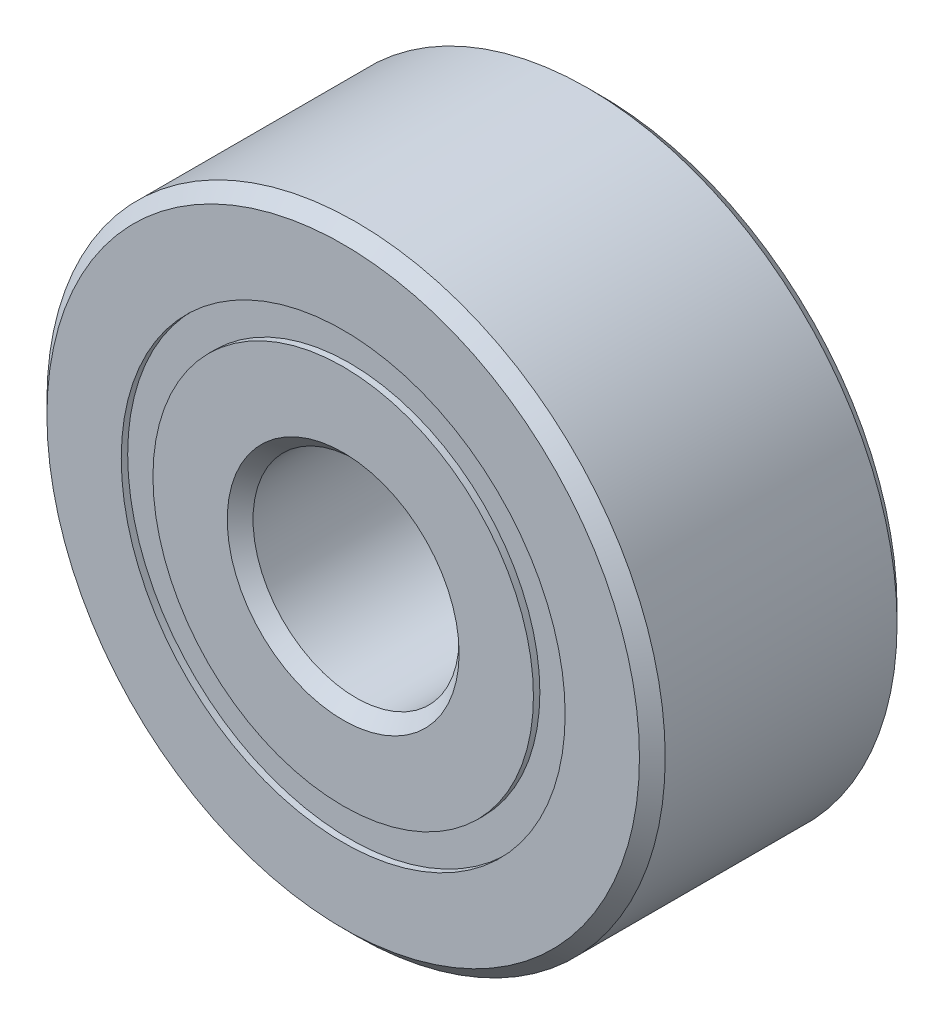
ISO-10303-21;
HEADER;
FILE_DESCRIPTION(('STEP AP214'),'2;1');
FILE_NAME('part.step','',(''),(''),'','','');
FILE_SCHEMA(('AUTOMOTIVE_DESIGN { 1 0 10303 214 1 1 1 1 }'));
ENDSEC;
DATA;
#1=APPLICATION_CONTEXT('core data for automotive mechanical design processes');
#2=APPLICATION_PROTOCOL_DEFINITION('international standard','automotive_design',2000,#1);
#3=PRODUCT_CONTEXT('',#1,'mechanical');
#4=PRODUCT('Part','Part','',(#3));
#5=PRODUCT_RELATED_PRODUCT_CATEGORY('part','',(#4));
#6=PRODUCT_DEFINITION_FORMATION('','',#4);
#7=PRODUCT_DEFINITION_CONTEXT('part definition',#1,'design');
#8=PRODUCT_DEFINITION('design','',#6,#7);
#9=PRODUCT_DEFINITION_SHAPE('','',#8);
#10=(LENGTH_UNIT() NAMED_UNIT(*) SI_UNIT(.MILLI.,.METRE.));
#11=(NAMED_UNIT(*) PLANE_ANGLE_UNIT() SI_UNIT($,.RADIAN.));
#12=(NAMED_UNIT(*) SI_UNIT($,.STERADIAN.) SOLID_ANGLE_UNIT());
#13=UNCERTAINTY_MEASURE_WITH_UNIT(LENGTH_MEASURE(1.E-05),#10,'distance_accuracy_value','');
#14=(GEOMETRIC_REPRESENTATION_CONTEXT(3) GLOBAL_UNCERTAINTY_ASSIGNED_CONTEXT((#13)) GLOBAL_UNIT_ASSIGNED_CONTEXT((#10,
#11,#12)) REPRESENTATION_CONTEXT('',''));
#15=CARTESIAN_POINT('',(0.,0.,0.));
#16=DIRECTION('',(0.,0.,1.));
#17=DIRECTION('',(1.,0.,0.));
#18=AXIS2_PLACEMENT_3D('',#15,#16,#17);
#19=CARTESIAN_POINT('',(0.,3.41923076923077,-1.88515625));
#20=DIRECTION('',(0.,0.,1.));
#21=DIRECTION('',(1.,0.,0.));
#22=AXIS2_PLACEMENT_3D('',#19,#20,#21);
#23=PLANE('',#22);
#24=CARTESIAN_POINT('',(0.,0.,-1.88515625));
#25=DIRECTION('',(0.,0.,1.));
#26=DIRECTION('',(1.,0.,0.));
#27=AXIS2_PLACEMENT_3D('',#24,#25,#26);
#28=CIRCLE('',#27,3.41923076923077);
#29=CARTESIAN_POINT('',(3.41923076923077,0.,-1.88515625));
#30=VERTEX_POINT('',#29);
#31=EDGE_CURVE('E63',#30,#30,#28,.T.);
#32=ORIENTED_EDGE('',*,*,#31,.F.);
#33=EDGE_LOOP('',(#32));
#34=FACE_BOUND('',#33,.T.);
#35=CARTESIAN_POINT('',(0.,0.,-1.88515625));
#36=DIRECTION('',(0.,0.,1.));
#37=DIRECTION('',(1.,0.,0.));
#38=AXIS2_PLACEMENT_3D('',#35,#36,#37);
#39=CIRCLE('',#38,2.93076923076923);
#40=CARTESIAN_POINT('',(2.93076923076923,0.,-1.88515625));
#41=VERTEX_POINT('',#40);
#42=EDGE_CURVE('E11',#41,#41,#39,.T.);
#43=ORIENTED_EDGE('',*,*,#42,.T.);
#44=EDGE_LOOP('',(#43));
#45=FACE_BOUND('',#44,.T.);
#46=ADVANCED_FACE('F49',(#34,#45),#23,.F.);
#47=CARTESIAN_POINT('',(0.,0.,1.984375));
#48=DIRECTION('',(0.,0.,1.));
#49=DIRECTION('',(1.,0.,0.));
#50=AXIS2_PLACEMENT_3D('',#47,#48,#49);
#51=CYLINDRICAL_SURFACE('',#50,2.93076923076923);
#52=ORIENTED_EDGE('',*,*,#42,.F.);
#53=EDGE_LOOP('',(#52));
#54=FACE_BOUND('',#53,.T.);
#55=CARTESIAN_POINT('',(0.,0.,-0.915136422466876));
#56=DIRECTION('',(0.,0.,1.));
#57=DIRECTION('',(1.,0.,0.));
#58=AXIS2_PLACEMENT_3D('',#55,#56,#57);
#59=CIRCLE('',#58,2.93076923076923);
#60=CARTESIAN_POINT('',(2.93076923076923,0.,-0.915136422466876));
#61=VERTEX_POINT('',#60);
#62=EDGE_CURVE('E55',#61,#61,#59,.T.);
#63=ORIENTED_EDGE('',*,*,#62,.T.);
#64=EDGE_LOOP('',(#63));
#65=FACE_BOUND('',#64,.T.);
#66=ADVANCED_FACE('F72',(#54,#65),#51,.F.);
#67=CARTESIAN_POINT('',(0.,3.41923076923077,-0.915136422466876));
#68=DIRECTION('',(0.,0.,-1.));
#69=DIRECTION('',(-1.,0.,0.));
#70=AXIS2_PLACEMENT_3D('',#67,#68,#69);
#71=PLANE('',#70);
#72=ORIENTED_EDGE('',*,*,#62,.F.);
#73=EDGE_LOOP('',(#72));
#74=FACE_BOUND('',#73,.T.);
#75=CARTESIAN_POINT('',(0.,0.,-0.915136422466876));
#76=DIRECTION('',(0.,0.,1.));
#77=DIRECTION('',(1.,0.,0.));
#78=AXIS2_PLACEMENT_3D('',#75,#76,#77);
#79=CIRCLE('',#78,3.41923076923077);
#80=CARTESIAN_POINT('',(3.41923076923077,0.,-0.915136422466876));
#81=VERTEX_POINT('',#80);
#82=EDGE_CURVE('E59',#81,#81,#79,.T.);
#83=ORIENTED_EDGE('',*,*,#82,.T.);
#84=EDGE_LOOP('',(#83));
#85=FACE_BOUND('',#84,.T.);
#86=ADVANCED_FACE('F76',(#74,#85),#71,.F.);
#87=CARTESIAN_POINT('',(0.,0.,1.984375));
#88=DIRECTION('',(0.,0.,1.));
#89=DIRECTION('',(1.,0.,0.));
#90=AXIS2_PLACEMENT_3D('',#87,#88,#89);
#91=CYLINDRICAL_SURFACE('',#90,3.41923076923077);
#92=ORIENTED_EDGE('',*,*,#82,.F.);
#93=EDGE_LOOP('',(#92));
#94=FACE_BOUND('',#93,.T.);
#95=ORIENTED_EDGE('',*,*,#31,.T.);
#96=EDGE_LOOP('',(#95));
#97=FACE_BOUND('',#96,.T.);
#98=ADVANCED_FACE('F69',(#94,#97),#91,.T.);
#99=CLOSED_SHELL('',(#46,#66,#86,#98));
#100=MANIFOLD_SOLID_BREP('B2',#99);
#101=CARTESIAN_POINT('',(0.,3.41923076923077,1.88515625));
#102=DIRECTION('',(0.,0.,-1.));
#103=DIRECTION('',(-1.,0.,0.));
#104=AXIS2_PLACEMENT_3D('',#101,#102,#103);
#105=PLANE('',#104);
#106=CARTESIAN_POINT('',(0.,0.,1.88515625));
#107=DIRECTION('',(0.,0.,1.));
#108=DIRECTION('',(1.,0.,0.));
#109=AXIS2_PLACEMENT_3D('',#106,#107,#108);
#110=CIRCLE('',#109,2.93076923076923);
#111=CARTESIAN_POINT('',(2.93076923076923,0.,1.88515625));
#112=VERTEX_POINT('',#111);
#113=EDGE_CURVE('E48',#112,#112,#110,.T.);
#114=ORIENTED_EDGE('',*,*,#113,.F.);
#115=EDGE_LOOP('',(#114));
#116=FACE_BOUND('',#115,.T.);
#117=CARTESIAN_POINT('',(0.,0.,1.88515625));
#118=DIRECTION('',(0.,0.,1.));
#119=DIRECTION('',(1.,0.,0.));
#120=AXIS2_PLACEMENT_3D('',#117,#118,#119);
#121=CIRCLE('',#120,3.41923076923077);
#122=CARTESIAN_POINT('',(3.41923076923077,0.,1.88515625));
#123=VERTEX_POINT('',#122);
#124=EDGE_CURVE('E130',#123,#123,#121,.T.);
#125=ORIENTED_EDGE('',*,*,#124,.T.);
#126=EDGE_LOOP('',(#125));
#127=FACE_BOUND('',#126,.T.);
#128=ADVANCED_FACE('F116',(#116,#127),#105,.F.);
#129=CARTESIAN_POINT('',(0.,0.,1.984375));
#130=DIRECTION('',(0.,0.,1.));
#131=DIRECTION('',(1.,0.,0.));
#132=AXIS2_PLACEMENT_3D('',#129,#130,#131);
#133=CYLINDRICAL_SURFACE('',#132,2.93076923076923);
#134=CARTESIAN_POINT('',(0.,0.,0.915136422466876));
#135=DIRECTION('',(0.,0.,1.));
#136=DIRECTION('',(1.,0.,0.));
#137=AXIS2_PLACEMENT_3D('',#134,#135,#136);
#138=CIRCLE('',#137,2.93076923076923);
#139=CARTESIAN_POINT('',(2.93076923076923,0.,0.915136422466876));
#140=VERTEX_POINT('',#139);
#141=EDGE_CURVE('E122',#140,#140,#138,.T.);
#142=ORIENTED_EDGE('',*,*,#141,.F.);
#143=EDGE_LOOP('',(#142));
#144=FACE_BOUND('',#143,.T.);
#145=ORIENTED_EDGE('',*,*,#113,.T.);
#146=EDGE_LOOP('',(#145));
#147=FACE_BOUND('',#146,.T.);
#148=ADVANCED_FACE('F145',(#144,#147),#133,.F.);
#149=CARTESIAN_POINT('',(0.,3.41923076923077,0.915136422466876));
#150=DIRECTION('',(0.,0.,1.));
#151=DIRECTION('',(1.,0.,0.));
#152=AXIS2_PLACEMENT_3D('',#149,#150,#151);
#153=PLANE('',#152);
#154=CARTESIAN_POINT('',(0.,0.,0.915136422466876));
#155=DIRECTION('',(0.,0.,1.));
#156=DIRECTION('',(1.,0.,0.));
#157=AXIS2_PLACEMENT_3D('',#154,#155,#156);
#158=CIRCLE('',#157,3.41923076923077);
#159=CARTESIAN_POINT('',(3.41923076923077,0.,0.915136422466876));
#160=VERTEX_POINT('',#159);
#161=EDGE_CURVE('E126',#160,#160,#158,.T.);
#162=ORIENTED_EDGE('',*,*,#161,.F.);
#163=EDGE_LOOP('',(#162));
#164=FACE_BOUND('',#163,.T.);
#165=ORIENTED_EDGE('',*,*,#141,.T.);
#166=EDGE_LOOP('',(#165));
#167=FACE_BOUND('',#166,.T.);
#168=ADVANCED_FACE('F140',(#164,#167),#153,.F.);
#169=CARTESIAN_POINT('',(0.,0.,1.984375));
#170=DIRECTION('',(0.,0.,1.));
#171=DIRECTION('',(1.,0.,0.));
#172=AXIS2_PLACEMENT_3D('',#169,#170,#171);
#173=CYLINDRICAL_SURFACE('',#172,3.41923076923077);
#174=ORIENTED_EDGE('',*,*,#124,.F.);
#175=EDGE_LOOP('',(#174));
#176=FACE_BOUND('',#175,.T.);
#177=ORIENTED_EDGE('',*,*,#161,.T.);
#178=EDGE_LOOP('',(#177));
#179=FACE_BOUND('',#178,.T.);
#180=ADVANCED_FACE('F137',(#176,#179),#173,.T.);
#181=CLOSED_SHELL('',(#128,#148,#168,#180));
#182=MANIFOLD_SOLID_BREP('B6',#181);
#183=CARTESIAN_POINT('',(-2.74963065701557,1.58750000000003,0.));
#184=DIRECTION('',(0.,0.,1.));
#185=DIRECTION('',(-0.866025403784433,0.50000000000001,0.));
#186=AXIS2_PLACEMENT_3D('',#183,#184,#185);
#187=SPHERICAL_SURFACE('',#186,0.915136422466876);
#188=CARTESIAN_POINT('',(-2.74963065701557,1.58750000000003,0.915136422466876));
#189=VERTEX_POINT('',#188);
#190=VERTEX_LOOP('',#189);
#191=FACE_BOUND('',#190,.T.);
#192=ADVANCED_FACE('F183',(#191),#187,.T.);
#193=CLOSED_SHELL('',(#192));
#194=MANIFOLD_SOLID_BREP('B43',#193);
#195=CARTESIAN_POINT('',(-2.74963065701561,-1.58749999999997,0.));
#196=DIRECTION('',(0.,0.,1.));
#197=DIRECTION('',(-0.866025403784443,-0.499999999999992,0.));
#198=AXIS2_PLACEMENT_3D('',#195,#196,#197);
#199=SPHERICAL_SURFACE('',#198,0.915136422466876);
#200=CARTESIAN_POINT('',(-2.74963065701561,-1.58749999999997,0.915136422466876));
#201=VERTEX_POINT('',#200);
#202=VERTEX_LOOP('',#201);
#203=FACE_BOUND('',#202,.T.);
#204=ADVANCED_FACE('F203',(#203),#199,.T.);
#205=CLOSED_SHELL('',(#204));
#206=MANIFOLD_SOLID_BREP('B112',#205);
#207=CARTESIAN_POINT('',(0.,-3.175,0.));
#208=DIRECTION('',(0.,0.,1.));
#209=DIRECTION('',(0.,-1.,0.));
#210=AXIS2_PLACEMENT_3D('',#207,#208,#209);
#211=SPHERICAL_SURFACE('',#210,0.915136422466876);
#212=CARTESIAN_POINT('',(0.,-3.175,0.915136422466876));
#213=VERTEX_POINT('',#212);
#214=VERTEX_LOOP('',#213);
#215=FACE_BOUND('',#214,.T.);
#216=ADVANCED_FACE('F223',(#215),#211,.T.);
#217=CLOSED_SHELL('',(#216));
#218=MANIFOLD_SOLID_BREP('B179',#217);
#219=CARTESIAN_POINT('',(2.74963065701559,-1.58750000000001,0.));
#220=DIRECTION('',(0.,0.,1.));
#221=DIRECTION('',(0.866025403784436,-0.500000000000004,0.));
#222=AXIS2_PLACEMENT_3D('',#219,#220,#221);
#223=SPHERICAL_SURFACE('',#222,0.915136422466876);
#224=CARTESIAN_POINT('',(2.74963065701559,-1.58750000000001,0.915136422466876));
#225=VERTEX_POINT('',#224);
#226=VERTEX_LOOP('',#225);
#227=FACE_BOUND('',#226,.T.);
#228=ADVANCED_FACE('F243',(#227),#223,.T.);
#229=CLOSED_SHELL('',(#228));
#230=MANIFOLD_SOLID_BREP('B199',#229);
#231=CARTESIAN_POINT('',(2.7496306570156,1.58749999999999,0.));
#232=DIRECTION('',(0.,0.,1.));
#233=DIRECTION('',(0.86602540378444,0.499999999999998,0.));
#234=AXIS2_PLACEMENT_3D('',#231,#232,#233);
#235=SPHERICAL_SURFACE('',#234,0.915136422466876);
#236=CARTESIAN_POINT('',(2.7496306570156,1.58749999999999,0.915136422466876));
#237=VERTEX_POINT('',#236);
#238=VERTEX_LOOP('',#237);
#239=FACE_BOUND('',#238,.T.);
#240=ADVANCED_FACE('F263',(#239),#235,.T.);
#241=CLOSED_SHELL('',(#240));
#242=MANIFOLD_SOLID_BREP('B219',#241);
#243=CARTESIAN_POINT('',(0.,3.175,0.));
#244=DIRECTION('',(0.,0.,1.));
#245=DIRECTION('',(0.,1.,0.));
#246=AXIS2_PLACEMENT_3D('',#243,#244,#245);
#247=SPHERICAL_SURFACE('',#246,0.915136422466876);
#248=CARTESIAN_POINT('',(0.,3.175,0.915136422466876));
#249=VERTEX_POINT('',#248);
#250=VERTEX_LOOP('',#249);
#251=FACE_BOUND('',#250,.T.);
#252=ADVANCED_FACE('F285',(#251),#247,.T.);
#253=CLOSED_SHELL('',(#252));
#254=MANIFOLD_SOLID_BREP('B239',#253);
#255=CARTESIAN_POINT('',(0.,2.93076923076923,1.984375));
#256=DIRECTION('',(0.,0.,-1.));
#257=DIRECTION('',(-1.,0.,0.));
#258=AXIS2_PLACEMENT_3D('',#255,#256,#257);
#259=PLANE('',#258);
#260=CARTESIAN_POINT('',(0.,0.,1.984375));
#261=DIRECTION('',(0.,0.,1.));
#262=DIRECTION('',(1.,0.,0.));
#263=AXIS2_PLACEMENT_3D('',#260,#261,#262);
#264=CIRCLE('',#263,1.7859375);
#265=CARTESIAN_POINT('',(1.7859375,0.,1.984375));
#266=VERTEX_POINT('',#265);
#267=EDGE_CURVE('E332',#266,#266,#264,.T.);
#268=ORIENTED_EDGE('',*,*,#267,.F.);
#269=EDGE_LOOP('',(#268));
#270=FACE_BOUND('',#269,.T.);
#271=CARTESIAN_POINT('',(0.,0.,1.984375));
#272=DIRECTION('',(0.,0.,1.));
#273=DIRECTION('',(1.,0.,0.));
#274=AXIS2_PLACEMENT_3D('',#271,#272,#273);
#275=CIRCLE('',#274,2.93076923076923);
#276=CARTESIAN_POINT('',(2.93076923076923,0.,1.984375));
#277=VERTEX_POINT('',#276);
#278=EDGE_CURVE('E284',#277,#277,#275,.T.);
#279=ORIENTED_EDGE('',*,*,#278,.T.);
#280=EDGE_LOOP('',(#279));
#281=FACE_BOUND('',#280,.T.);
#282=ADVANCED_FACE('F304',(#270,#281),#259,.F.);
#283=CARTESIAN_POINT('',(0.,0.,1.984375));
#284=DIRECTION('',(0.,0.,1.));
#285=DIRECTION('',(1.,0.,0.));
#286=AXIS2_PLACEMENT_3D('',#283,#284,#285);
#287=CYLINDRICAL_SURFACE('',#286,2.93076923076923);
#288=ORIENTED_EDGE('',*,*,#278,.F.);
#289=EDGE_LOOP('',(#288));
#290=FACE_BOUND('',#289,.T.);
#291=CARTESIAN_POINT('',(0.,0.,0.881944444444444));
#292=DIRECTION('',(0.,0.,1.));
#293=DIRECTION('',(1.,0.,0.));
#294=AXIS2_PLACEMENT_3D('',#291,#292,#293);
#295=CIRCLE('',#294,2.93076923076923);
#296=CARTESIAN_POINT('',(2.93076923076923,0.,0.881944444444444));
#297=VERTEX_POINT('',#296);
#298=EDGE_CURVE('E310',#297,#297,#295,.T.);
#299=ORIENTED_EDGE('',*,*,#298,.T.);
#300=EDGE_LOOP('',(#299));
#301=FACE_BOUND('',#300,.T.);
#302=ADVANCED_FACE('F339',(#290,#301),#287,.T.);
#303=CARTESIAN_POINT('',(0.,0.,0.));
#304=DIRECTION('',(0.,0.,1.));
#305=DIRECTION('',(1.,0.,0.));
#306=AXIS2_PLACEMENT_3D('',#303,#304,#305);
#307=TOROIDAL_SURFACE('',#306,3.17499999999999,0.915136422466875);
#308=ORIENTED_EDGE('',*,*,#298,.F.);
#309=EDGE_LOOP('',(#308));
#310=FACE_BOUND('',#309,.T.);
#311=CARTESIAN_POINT('',(0.,0.,-0.881944444444445));
#312=DIRECTION('',(0.,0.,1.));
#313=DIRECTION('',(1.,0.,0.));
#314=AXIS2_PLACEMENT_3D('',#311,#312,#313);
#315=CIRCLE('',#314,2.93076923076923);
#316=CARTESIAN_POINT('',(2.93076923076923,0.,-0.881944444444445));
#317=VERTEX_POINT('',#316);
#318=EDGE_CURVE('E314',#317,#317,#315,.T.);
#319=ORIENTED_EDGE('',*,*,#318,.T.);
#320=EDGE_LOOP('',(#319));
#321=FACE_BOUND('',#320,.T.);
#322=ADVANCED_FACE('F343',(#310,#321),#307,.F.);
#323=CARTESIAN_POINT('',(0.,0.,1.984375));
#324=DIRECTION('',(0.,0.,1.));
#325=DIRECTION('',(1.,0.,0.));
#326=AXIS2_PLACEMENT_3D('',#323,#324,#325);
#327=CYLINDRICAL_SURFACE('',#326,2.93076923076923);
#328=ORIENTED_EDGE('',*,*,#318,.F.);
#329=EDGE_LOOP('',(#328));
#330=FACE_BOUND('',#329,.T.);
#331=CARTESIAN_POINT('',(0.,0.,-1.984375));
#332=DIRECTION('',(0.,0.,1.));
#333=DIRECTION('',(1.,0.,0.));
#334=AXIS2_PLACEMENT_3D('',#331,#332,#333);
#335=CIRCLE('',#334,2.93076923076923);
#336=CARTESIAN_POINT('',(2.93076923076923,0.,-1.984375));
#337=VERTEX_POINT('',#336);
#338=EDGE_CURVE('E318',#337,#337,#335,.T.);
#339=ORIENTED_EDGE('',*,*,#338,.T.);
#340=EDGE_LOOP('',(#339));
#341=FACE_BOUND('',#340,.T.);
#342=ADVANCED_FACE('F348',(#330,#341),#327,.T.);
#343=CARTESIAN_POINT('',(0.,1.7859375,-1.984375));
#344=DIRECTION('',(0.,0.,1.));
#345=DIRECTION('',(1.,0.,0.));
#346=AXIS2_PLACEMENT_3D('',#343,#344,#345);
#347=PLANE('',#346);
#348=ORIENTED_EDGE('',*,*,#338,.F.);
#349=EDGE_LOOP('',(#348));
#350=FACE_BOUND('',#349,.T.);
#351=CARTESIAN_POINT('',(0.,0.,-1.984375));
#352=DIRECTION('',(0.,0.,1.));
#353=DIRECTION('',(1.,0.,0.));
#354=AXIS2_PLACEMENT_3D('',#351,#352,#353);
#355=CIRCLE('',#354,1.7859375);
#356=CARTESIAN_POINT('',(1.7859375,0.,-1.984375));
#357=VERTEX_POINT('',#356);
#358=EDGE_CURVE('E323',#357,#357,#355,.T.);
#359=ORIENTED_EDGE('',*,*,#358,.T.);
#360=EDGE_LOOP('',(#359));
#361=FACE_BOUND('',#360,.T.);
#362=ADVANCED_FACE('F354',(#350,#361),#347,.F.);
#363=CARTESIAN_POINT('',(0.,0.,-1.7859375));
#364=DIRECTION('',(0.,0.,-1.));
#365=DIRECTION('',(-1.,0.,0.));
#366=AXIS2_PLACEMENT_3D('',#363,#364,#365);
#367=CONICAL_SURFACE('',#366,1.5875,0.785398163397445);
#368=ORIENTED_EDGE('',*,*,#358,.F.);
#369=EDGE_LOOP('',(#368));
#370=FACE_BOUND('',#369,.T.);
#371=CARTESIAN_POINT('',(0.,0.,-1.7859375));
#372=DIRECTION('',(0.,0.,1.));
#373=DIRECTION('',(1.,0.,0.));
#374=AXIS2_PLACEMENT_3D('',#371,#372,#373);
#375=CIRCLE('',#374,1.5875);
#376=CARTESIAN_POINT('',(1.5875,0.,-1.7859375));
#377=VERTEX_POINT('',#376);
#378=EDGE_CURVE('E326',#377,#377,#375,.T.);
#379=ORIENTED_EDGE('',*,*,#378,.T.);
#380=EDGE_LOOP('',(#379));
#381=FACE_BOUND('',#380,.T.);
#382=ADVANCED_FACE('F358',(#370,#381),#367,.F.);
#383=CARTESIAN_POINT('',(0.,0.,1.984375));
#384=DIRECTION('',(0.,0.,1.));
#385=DIRECTION('',(1.,0.,0.));
#386=AXIS2_PLACEMENT_3D('',#383,#384,#385);
#387=CYLINDRICAL_SURFACE('',#386,1.5875);
#388=ORIENTED_EDGE('',*,*,#378,.F.);
#389=EDGE_LOOP('',(#388));
#390=FACE_BOUND('',#389,.T.);
#391=CARTESIAN_POINT('',(0.,0.,1.7859375));
#392=DIRECTION('',(0.,0.,1.));
#393=DIRECTION('',(1.,0.,0.));
#394=AXIS2_PLACEMENT_3D('',#391,#392,#393);
#395=CIRCLE('',#394,1.5875);
#396=CARTESIAN_POINT('',(1.5875,0.,1.7859375));
#397=VERTEX_POINT('',#396);
#398=EDGE_CURVE('E329',#397,#397,#395,.T.);
#399=ORIENTED_EDGE('',*,*,#398,.T.);
#400=EDGE_LOOP('',(#399));
#401=FACE_BOUND('',#400,.T.);
#402=ADVANCED_FACE('F362',(#390,#401),#387,.F.);
#403=CARTESIAN_POINT('',(0.,0.,1.984375));
#404=DIRECTION('',(0.,0.,1.));
#405=DIRECTION('',(1.,0.,0.));
#406=AXIS2_PLACEMENT_3D('',#403,#404,#405);
#407=CONICAL_SURFACE('',#406,1.7859375,0.785398163397449);
#408=ORIENTED_EDGE('',*,*,#398,.F.);
#409=EDGE_LOOP('',(#408));
#410=FACE_BOUND('',#409,.T.);
#411=ORIENTED_EDGE('',*,*,#267,.T.);
#412=EDGE_LOOP('',(#411));
#413=FACE_BOUND('',#412,.T.);
#414=ADVANCED_FACE('F336',(#410,#413),#407,.F.);
#415=CLOSED_SHELL('',(#282,#302,#322,#342,#362,#382,#402,#414));
#416=MANIFOLD_SOLID_BREP('B259',#415);
#417=CARTESIAN_POINT('',(0.,0.,1.7859375));
#418=DIRECTION('',(0.,0.,-1.));
#419=DIRECTION('',(-1.,0.,0.));
#420=AXIS2_PLACEMENT_3D('',#417,#418,#419);
#421=CONICAL_SURFACE('',#420,4.7625,0.785398163397449);
#422=CARTESIAN_POINT('',(0.,0.,1.984375));
#423=DIRECTION('',(0.,0.,1.));
#424=DIRECTION('',(1.,0.,0.));
#425=AXIS2_PLACEMENT_3D('',#422,#423,#424);
#426=CIRCLE('',#425,4.5640625);
#427=CARTESIAN_POINT('',(4.5640625,0.,1.984375));
#428=VERTEX_POINT('',#427);
#429=EDGE_CURVE('E460',#428,#428,#426,.T.);
#430=ORIENTED_EDGE('',*,*,#429,.F.);
#431=EDGE_LOOP('',(#430));
#432=FACE_BOUND('',#431,.T.);
#433=CARTESIAN_POINT('',(0.,0.,1.7859375));
#434=DIRECTION('',(0.,0.,1.));
#435=DIRECTION('',(1.,0.,0.));
#436=AXIS2_PLACEMENT_3D('',#433,#434,#435);
#437=CIRCLE('',#436,4.7625);
#438=CARTESIAN_POINT('',(4.7625,0.,1.7859375));
#439=VERTEX_POINT('',#438);
#440=EDGE_CURVE('E303',#439,#439,#437,.T.);
#441=ORIENTED_EDGE('',*,*,#440,.T.);
#442=EDGE_LOOP('',(#441));
#443=FACE_BOUND('',#442,.T.);
#444=ADVANCED_FACE('F425',(#432,#443),#421,.T.);
#445=CARTESIAN_POINT('',(0.,0.,1.984375));
#446=DIRECTION('',(0.,0.,1.));
#447=DIRECTION('',(1.,0.,0.));
#448=AXIS2_PLACEMENT_3D('',#445,#446,#447);
#449=CYLINDRICAL_SURFACE('',#448,4.7625);
#450=ORIENTED_EDGE('',*,*,#440,.F.);
#451=EDGE_LOOP('',(#450));
#452=FACE_BOUND('',#451,.T.);
#453=CARTESIAN_POINT('',(0.,0.,-1.7859375));
#454=DIRECTION('',(0.,0.,1.));
#455=DIRECTION('',(1.,0.,0.));
#456=AXIS2_PLACEMENT_3D('',#453,#454,#455);
#457=CIRCLE('',#456,4.7625);
#458=CARTESIAN_POINT('',(4.7625,0.,-1.7859375));
#459=VERTEX_POINT('',#458);
#460=EDGE_CURVE('E432',#459,#459,#457,.T.);
#461=ORIENTED_EDGE('',*,*,#460,.T.);
#462=EDGE_LOOP('',(#461));
#463=FACE_BOUND('',#462,.T.);
#464=ADVANCED_FACE('F468',(#452,#463),#449,.T.);
#465=CARTESIAN_POINT('',(0.,0.,-1.984375));
#466=DIRECTION('',(0.,0.,1.));
#467=DIRECTION('',(1.,0.,0.));
#468=AXIS2_PLACEMENT_3D('',#465,#466,#467);
#469=CONICAL_SURFACE('',#468,4.5640625,0.785398163397448);
#470=ORIENTED_EDGE('',*,*,#460,.F.);
#471=EDGE_LOOP('',(#470));
#472=FACE_BOUND('',#471,.T.);
#473=CARTESIAN_POINT('',(0.,0.,-1.984375));
#474=DIRECTION('',(0.,0.,1.));
#475=DIRECTION('',(1.,0.,0.));
#476=AXIS2_PLACEMENT_3D('',#473,#474,#475);
#477=CIRCLE('',#476,4.5640625);
#478=CARTESIAN_POINT('',(4.5640625,0.,-1.984375));
#479=VERTEX_POINT('',#478);
#480=EDGE_CURVE('E437',#479,#479,#477,.T.);
#481=ORIENTED_EDGE('',*,*,#480,.T.);
#482=EDGE_LOOP('',(#481));
#483=FACE_BOUND('',#482,.T.);
#484=ADVANCED_FACE('F472',(#472,#483),#469,.T.);
#485=CARTESIAN_POINT('',(0.,4.5640625,-1.984375));
#486=DIRECTION('',(0.,0.,1.));
#487=DIRECTION('',(1.,0.,0.));
#488=AXIS2_PLACEMENT_3D('',#485,#486,#487);
#489=PLANE('',#488);
#490=ORIENTED_EDGE('',*,*,#480,.F.);
#491=EDGE_LOOP('',(#490));
#492=FACE_BOUND('',#491,.T.);
#493=CARTESIAN_POINT('',(0.,0.,-1.984375));
#494=DIRECTION('',(0.,0.,1.));
#495=DIRECTION('',(1.,0.,0.));
#496=AXIS2_PLACEMENT_3D('',#493,#494,#495);
#497=CIRCLE('',#496,3.41923076923077);
#498=CARTESIAN_POINT('',(3.41923076923077,0.,-1.984375));
#499=VERTEX_POINT('',#498);
#500=EDGE_CURVE('E442',#499,#499,#497,.T.);
#501=ORIENTED_EDGE('',*,*,#500,.T.);
#502=EDGE_LOOP('',(#501));
#503=FACE_BOUND('',#502,.T.);
#504=ADVANCED_FACE('F477',(#492,#503),#489,.F.);
#505=CARTESIAN_POINT('',(0.,0.,1.984375));
#506=DIRECTION('',(0.,0.,1.));
#507=DIRECTION('',(1.,0.,0.));
#508=AXIS2_PLACEMENT_3D('',#505,#506,#507);
#509=CYLINDRICAL_SURFACE('',#508,3.41923076923077);
#510=ORIENTED_EDGE('',*,*,#500,.F.);
#511=EDGE_LOOP('',(#510));
#512=FACE_BOUND('',#511,.T.);
#513=CARTESIAN_POINT('',(0.,0.,-0.881944444444445));
#514=DIRECTION('',(0.,0.,1.));
#515=DIRECTION('',(1.,0.,0.));
#516=AXIS2_PLACEMENT_3D('',#513,#514,#515);
#517=CIRCLE('',#516,3.41923076923077);
#518=CARTESIAN_POINT('',(3.41923076923077,0.,-0.881944444444445));
#519=VERTEX_POINT('',#518);
#520=EDGE_CURVE('E448',#519,#519,#517,.T.);
#521=ORIENTED_EDGE('',*,*,#520,.T.);
#522=EDGE_LOOP('',(#521));
#523=FACE_BOUND('',#522,.T.);
#524=ADVANCED_FACE('F483',(#512,#523),#509,.F.);
#525=CARTESIAN_POINT('',(0.,0.,0.));
#526=DIRECTION('',(0.,0.,1.));
#527=DIRECTION('',(1.,0.,0.));
#528=AXIS2_PLACEMENT_3D('',#525,#526,#527);
#529=TOROIDAL_SURFACE('',#528,3.175,0.915136422466876);
#530=ORIENTED_EDGE('',*,*,#520,.F.);
#531=EDGE_LOOP('',(#530));
#532=FACE_BOUND('',#531,.T.);
#533=CARTESIAN_POINT('',(0.,0.,0.881944444444444));
#534=DIRECTION('',(0.,0.,1.));
#535=DIRECTION('',(1.,0.,0.));
#536=AXIS2_PLACEMENT_3D('',#533,#534,#535);
#537=CIRCLE('',#536,3.41923076923077);
#538=CARTESIAN_POINT('',(3.41923076923077,0.,0.881944444444444));
#539=VERTEX_POINT('',#538);
#540=EDGE_CURVE('E452',#539,#539,#537,.T.);
#541=ORIENTED_EDGE('',*,*,#540,.T.);
#542=EDGE_LOOP('',(#541));
#543=FACE_BOUND('',#542,.T.);
#544=ADVANCED_FACE('F487',(#532,#543),#529,.F.);
#545=CARTESIAN_POINT('',(0.,0.,1.984375));
#546=DIRECTION('',(0.,0.,1.));
#547=DIRECTION('',(1.,0.,0.));
#548=AXIS2_PLACEMENT_3D('',#545,#546,#547);
#549=CYLINDRICAL_SURFACE('',#548,3.41923076923077);
#550=ORIENTED_EDGE('',*,*,#540,.F.);
#551=EDGE_LOOP('',(#550));
#552=FACE_BOUND('',#551,.T.);
#553=CARTESIAN_POINT('',(0.,0.,1.984375));
#554=DIRECTION('',(0.,0.,1.));
#555=DIRECTION('',(1.,0.,0.));
#556=AXIS2_PLACEMENT_3D('',#553,#554,#555);
#557=CIRCLE('',#556,3.41923076923077);
#558=CARTESIAN_POINT('',(3.41923076923077,0.,1.984375));
#559=VERTEX_POINT('',#558);
#560=EDGE_CURVE('E456',#559,#559,#557,.T.);
#561=ORIENTED_EDGE('',*,*,#560,.T.);
#562=EDGE_LOOP('',(#561));
#563=FACE_BOUND('',#562,.T.);
#564=ADVANCED_FACE('F491',(#552,#563),#549,.F.);
#565=CARTESIAN_POINT('',(0.,4.5640625,1.984375));
#566=DIRECTION('',(0.,0.,-1.));
#567=DIRECTION('',(-1.,0.,0.));
#568=AXIS2_PLACEMENT_3D('',#565,#566,#567);
#569=PLANE('',#568);
#570=ORIENTED_EDGE('',*,*,#560,.F.);
#571=EDGE_LOOP('',(#570));
#572=FACE_BOUND('',#571,.T.);
#573=ORIENTED_EDGE('',*,*,#429,.T.);
#574=EDGE_LOOP('',(#573));
#575=FACE_BOUND('',#574,.T.);
#576=ADVANCED_FACE('F465',(#572,#575),#569,.F.);
#577=CLOSED_SHELL('',(#444,#464,#484,#504,#524,#544,#564,#576));
#578=MANIFOLD_SOLID_BREP('B279',#577);
#579=ADVANCED_BREP_SHAPE_REPRESENTATION('',(#18,#100,#182,#194,#206,#218,#230,#242,#254,#416,
#578),#14);
#580=SHAPE_DEFINITION_REPRESENTATION(#9,#579);
ENDSEC;
END-ISO-10303-21;
